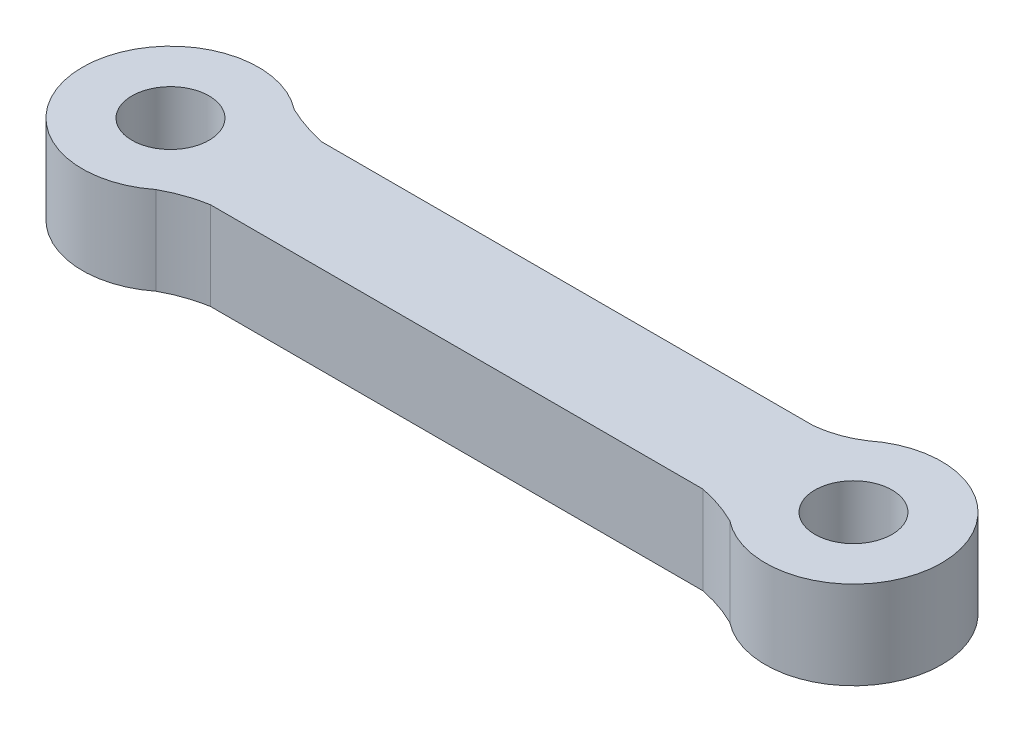
ISO-10303-21;
HEADER;
FILE_DESCRIPTION(('STEP AP214'),'2;1');
FILE_NAME('part.step','',(''),(''),'','','');
FILE_SCHEMA(('AUTOMOTIVE_DESIGN { 1 0 10303 214 1 1 1 1 }'));
ENDSEC;
DATA;
#1=APPLICATION_CONTEXT('core data for automotive mechanical design processes');
#2=APPLICATION_PROTOCOL_DEFINITION('international standard','automotive_design',2000,#1);
#3=PRODUCT_CONTEXT('',#1,'mechanical');
#4=PRODUCT('Part','Part','',(#3));
#5=PRODUCT_RELATED_PRODUCT_CATEGORY('part','',(#4));
#6=PRODUCT_DEFINITION_FORMATION('','',#4);
#7=PRODUCT_DEFINITION_CONTEXT('part definition',#1,'design');
#8=PRODUCT_DEFINITION('design','',#6,#7);
#9=PRODUCT_DEFINITION_SHAPE('','',#8);
#10=(LENGTH_UNIT() NAMED_UNIT(*) SI_UNIT(.MILLI.,.METRE.));
#11=(NAMED_UNIT(*) PLANE_ANGLE_UNIT() SI_UNIT($,.RADIAN.));
#12=(NAMED_UNIT(*) SI_UNIT($,.STERADIAN.) SOLID_ANGLE_UNIT());
#13=UNCERTAINTY_MEASURE_WITH_UNIT(LENGTH_MEASURE(1.E-05),#10,'distance_accuracy_value','');
#14=(GEOMETRIC_REPRESENTATION_CONTEXT(3) GLOBAL_UNCERTAINTY_ASSIGNED_CONTEXT((#13)) GLOBAL_UNIT_ASSIGNED_CONTEXT((#10,
#11,#12)) REPRESENTATION_CONTEXT('',''));
#15=CARTESIAN_POINT('',(0.,0.,0.));
#16=DIRECTION('',(0.,0.,1.));
#17=DIRECTION('',(1.,0.,0.));
#18=AXIS2_PLACEMENT_3D('',#15,#16,#17);
#19=CARTESIAN_POINT('',(12.1316284857943,4.,2.75907287233486));
#20=DIRECTION('',(0.,1.,0.));
#21=DIRECTION('',(0.,0.,1.));
#22=AXIS2_PLACEMENT_3D('',#19,#20,#21);
#23=PLANE('',#22);
#24=CARTESIAN_POINT('',(-15.4995,4.,0.));
#25=DIRECTION('',(0.,1.,0.));
#26=DIRECTION('',(0.,0.,1.));
#27=AXIS2_PLACEMENT_3D('',#24,#25,#26);
#28=CIRCLE('',#27,1.75);
#29=CARTESIAN_POINT('',(-15.4995,4.,1.75));
#30=VERTEX_POINT('',#29);
#31=EDGE_CURVE('E224',#30,#30,#28,.T.);
#32=ORIENTED_EDGE('',*,*,#31,.F.);
#33=EDGE_LOOP('',(#32));
#34=FACE_BOUND('',#33,.T.);
#35=CARTESIAN_POINT('',(11.1719060382681,4.,2.5005385286423));
#36=CARTESIAN_POINT('',(12.1633509333205,4.,2.700124355971));
#37=CARTESIAN_POINT('',(13.0279060382681,4.,3.13550424875513));
#38=B_SPLINE_CURVE_WITH_KNOTS('',2,(#35,#36,#37),.UNSPECIFIED.,.F.,.F.,(3,3),(0.,
0.38103348480159),.UNSPECIFIED.);
#39=CARTESIAN_POINT('',(11.1719060382681,4.,2.5005385286423));
#40=VERTEX_POINT('',#39);
#41=CARTESIAN_POINT('',(13.0279060382681,4.,3.13550424875513));
#42=VERTEX_POINT('',#41);
#43=EDGE_CURVE('E231',#40,#42,#38,.T.);
#44=ORIENTED_EDGE('',*,*,#43,.T.);
#45=CARTESIAN_POINT('',(15.5019060382681,4.,-0.00763494638083683));
#46=DIRECTION('',(0.,1.,0.));
#47=DIRECTION('',(0.,0.,1.));
#48=AXIS2_PLACEMENT_3D('',#45,#46,#47);
#49=CIRCLE('',#48,4.);
#50=CARTESIAN_POINT('',(13.0146335983677,4.,-3.14028172023076));
#51=VERTEX_POINT('',#50);
#52=EDGE_CURVE('E101',#42,#51,#49,.T.);
#53=ORIENTED_EDGE('',*,*,#52,.T.);
#54=CARTESIAN_POINT('',(13.0146335983677,4.,-3.14028172023076));
#55=CARTESIAN_POINT('',(12.2078267194761,4.,-2.6089021850615));
#56=CARTESIAN_POINT('',(11.1719060382681,4.,-2.4994614713577));
#57=B_SPLINE_CURVE_WITH_KNOTS('',2,(#54,#55,#56),.UNSPECIFIED.,.F.,.F.,(3,3),(0.,
0.652329483815014),.UNSPECIFIED.);
#58=CARTESIAN_POINT('',(11.1719060382681,4.,-2.4994614713577));
#59=VERTEX_POINT('',#58);
#60=EDGE_CURVE('E173',#51,#59,#57,.T.);
#61=ORIENTED_EDGE('',*,*,#60,.T.);
#62=DIRECTION('',(-1.,0.,0.));
#63=VECTOR('',#62,1.);
#64=CARTESIAN_POINT('',(-11.1670939617319,4.,-2.4994614713577));
#65=LINE('',#64,#63);
#66=CARTESIAN_POINT('',(-11.1670939617319,4.,-2.4994614713577));
#67=VERTEX_POINT('',#66);
#68=EDGE_CURVE('E167',#59,#67,#65,.T.);
#69=ORIENTED_EDGE('',*,*,#68,.T.);
#70=CARTESIAN_POINT('',(-11.1670939617319,4.,-2.4994614713577));
#71=CARTESIAN_POINT('',(-12.1502379917525,4.,-2.72768663302441));
#72=CARTESIAN_POINT('',(-13.0255,4.,-3.14313919513597));
#73=B_SPLINE_CURVE_WITH_KNOTS('',2,(#70,#71,#72),.UNSPECIFIED.,.F.,.F.,(3,3),(0.,
0.309192528281445),.UNSPECIFIED.);
#74=CARTESIAN_POINT('',(-13.0255,4.,-3.14313919513597));
#75=VERTEX_POINT('',#74);
#76=EDGE_CURVE('E120',#67,#75,#73,.T.);
#77=ORIENTED_EDGE('',*,*,#76,.T.);
#78=CARTESIAN_POINT('',(-15.4995,4.,0.));
#79=DIRECTION('',(0.,1.,0.));
#80=DIRECTION('',(0.,0.,1.));
#81=AXIS2_PLACEMENT_3D('',#78,#79,#80);
#82=CIRCLE('',#81,4.);
#83=CARTESIAN_POINT('',(-13.0255,4.,3.14313919513597));
#84=VERTEX_POINT('',#83);
#85=EDGE_CURVE('E114',#75,#84,#82,.T.);
#86=ORIENTED_EDGE('',*,*,#85,.T.);
#87=CARTESIAN_POINT('',(-13.0255,4.,3.14313919513597));
#88=CARTESIAN_POINT('',(-12.1815028656276,4.,2.67325513686519));
#89=CARTESIAN_POINT('',(-11.1767201884037,4.,2.5005385286423));
#90=B_SPLINE_CURVE_WITH_KNOTS('',2,(#87,#88,#89),.UNSPECIFIED.,.F.,.F.,(3,3),(0.,
0.480047458850535),.UNSPECIFIED.);
#91=CARTESIAN_POINT('',(-11.1767201884037,4.,2.5005385286423));
#92=VERTEX_POINT('',#91);
#93=EDGE_CURVE('E118',#84,#92,#90,.T.);
#94=ORIENTED_EDGE('',*,*,#93,.T.);
#95=DIRECTION('',(1.,0.,0.));
#96=VECTOR('',#95,1.);
#97=CARTESIAN_POINT('',(-11.1767201884037,4.,2.5005385286423));
#98=LINE('',#97,#96);
#99=EDGE_CURVE('E58',#92,#40,#98,.T.);
#100=ORIENTED_EDGE('',*,*,#99,.T.);
#101=EDGE_LOOP('',(#44,#53,#61,#69,#77,#86,#94,#100));
#102=FACE_BOUND('',#101,.T.);
#103=CARTESIAN_POINT('',(15.5019060382681,4.,-0.00763494638083683));
#104=DIRECTION('',(0.,1.,0.));
#105=DIRECTION('',(0.,0.,1.));
#106=AXIS2_PLACEMENT_3D('',#103,#104,#105);
#107=CIRCLE('',#106,1.75);
#108=CARTESIAN_POINT('',(15.5019060382681,4.,1.74236505361916));
#109=VERTEX_POINT('',#108);
#110=EDGE_CURVE('E213',#109,#109,#107,.T.);
#111=ORIENTED_EDGE('',*,*,#110,.F.);
#112=EDGE_LOOP('',(#111));
#113=FACE_BOUND('',#112,.T.);
#114=ADVANCED_FACE('F39',(#34,#102,#113),#23,.T.);
#115=CARTESIAN_POINT('',(12.1316284857943,0.,2.75907287233486));
#116=DIRECTION('',(0.,1.,0.));
#117=DIRECTION('',(0.,0.,1.));
#118=AXIS2_PLACEMENT_3D('',#115,#116,#117);
#119=PLANE('',#118);
#120=CARTESIAN_POINT('',(11.1719060382681,0.,2.5005385286423));
#121=CARTESIAN_POINT('',(12.1633509333205,0.,2.700124355971));
#122=CARTESIAN_POINT('',(13.0279060382681,0.,3.13550424875513));
#123=B_SPLINE_CURVE_WITH_KNOTS('',2,(#120,#121,#122),.UNSPECIFIED.,.F.,.F.,(3,3),(0.,
0.38103348480159),.UNSPECIFIED.);
#124=CARTESIAN_POINT('',(11.1719060382681,0.,2.5005385286423));
#125=VERTEX_POINT('',#124);
#126=CARTESIAN_POINT('',(13.0279060382681,0.,3.13550424875513));
#127=VERTEX_POINT('',#126);
#128=EDGE_CURVE('E228',#125,#127,#123,.T.);
#129=ORIENTED_EDGE('',*,*,#128,.F.);
#130=DIRECTION('',(1.,0.,0.));
#131=VECTOR('',#130,1.);
#132=CARTESIAN_POINT('',(-11.1767201884037,0.,2.5005385286423));
#133=LINE('',#132,#131);
#134=CARTESIAN_POINT('',(-11.1767201884037,0.,2.5005385286423));
#135=VERTEX_POINT('',#134);
#136=EDGE_CURVE('E93',#135,#125,#133,.T.);
#137=ORIENTED_EDGE('',*,*,#136,.F.);
#138=CARTESIAN_POINT('',(-13.0255,0.,3.14313919513597));
#139=CARTESIAN_POINT('',(-12.1815028656276,0.,2.67325513686519));
#140=CARTESIAN_POINT('',(-11.1767201884037,0.,2.5005385286423));
#141=B_SPLINE_CURVE_WITH_KNOTS('',2,(#138,#139,#140),.UNSPECIFIED.,.F.,.F.,(3,3),(0.,
0.480047458850535),.UNSPECIFIED.);
#142=CARTESIAN_POINT('',(-13.0255,0.,3.14313919513597));
#143=VERTEX_POINT('',#142);
#144=EDGE_CURVE('E87',#143,#135,#141,.T.);
#145=ORIENTED_EDGE('',*,*,#144,.F.);
#146=CARTESIAN_POINT('',(-15.4995,0.,0.));
#147=DIRECTION('',(0.,1.,0.));
#148=DIRECTION('',(0.,0.,1.));
#149=AXIS2_PLACEMENT_3D('',#146,#147,#148);
#150=CIRCLE('',#149,4.);
#151=CARTESIAN_POINT('',(-13.0255,0.,-3.14313919513597));
#152=VERTEX_POINT('',#151);
#153=EDGE_CURVE('E129',#152,#143,#150,.T.);
#154=ORIENTED_EDGE('',*,*,#153,.F.);
#155=CARTESIAN_POINT('',(-11.1670939617319,0.,-2.4994614713577));
#156=CARTESIAN_POINT('',(-12.1502379917525,0.,-2.72768663302441));
#157=CARTESIAN_POINT('',(-13.0255,0.,-3.14313919513597));
#158=B_SPLINE_CURVE_WITH_KNOTS('',2,(#155,#156,#157),.UNSPECIFIED.,.F.,.F.,(3,3),(0.,
0.309192528281445),.UNSPECIFIED.);
#159=CARTESIAN_POINT('',(-11.1670939617319,0.,-2.4994614713577));
#160=VERTEX_POINT('',#159);
#161=EDGE_CURVE('E279',#160,#152,#158,.T.);
#162=ORIENTED_EDGE('',*,*,#161,.F.);
#163=DIRECTION('',(-1.,0.,0.));
#164=VECTOR('',#163,1.);
#165=CARTESIAN_POINT('',(-11.1670939617319,0.,-2.4994614713577));
#166=LINE('',#165,#164);
#167=CARTESIAN_POINT('',(11.1719060382681,0.,-2.4994614713577));
#168=VERTEX_POINT('',#167);
#169=EDGE_CURVE('E274',#168,#160,#166,.T.);
#170=ORIENTED_EDGE('',*,*,#169,.F.);
#171=CARTESIAN_POINT('',(13.0146335983677,0.,-3.14028172023076));
#172=CARTESIAN_POINT('',(12.2078267194761,0.,-2.6089021850615));
#173=CARTESIAN_POINT('',(11.1719060382681,0.,-2.4994614713577));
#174=B_SPLINE_CURVE_WITH_KNOTS('',2,(#171,#172,#173),.UNSPECIFIED.,.F.,.F.,(3,3),(0.,
0.652329483815014),.UNSPECIFIED.);
#175=CARTESIAN_POINT('',(13.0146335983677,0.,-3.14028172023076));
#176=VERTEX_POINT('',#175);
#177=EDGE_CURVE('E268',#176,#168,#174,.T.);
#178=ORIENTED_EDGE('',*,*,#177,.F.);
#179=CARTESIAN_POINT('',(15.5019060382681,0.,-0.00763494638083683));
#180=DIRECTION('',(0.,1.,0.));
#181=DIRECTION('',(0.,0.,1.));
#182=AXIS2_PLACEMENT_3D('',#179,#180,#181);
#183=CIRCLE('',#182,4.);
#184=EDGE_CURVE('E272',#127,#176,#183,.T.);
#185=ORIENTED_EDGE('',*,*,#184,.F.);
#186=EDGE_LOOP('',(#129,#137,#145,#154,#162,#170,#178,#185));
#187=FACE_BOUND('',#186,.T.);
#188=CARTESIAN_POINT('',(-15.4995,0.,0.));
#189=DIRECTION('',(0.,1.,0.));
#190=DIRECTION('',(0.,0.,1.));
#191=AXIS2_PLACEMENT_3D('',#188,#189,#190);
#192=CIRCLE('',#191,1.75);
#193=CARTESIAN_POINT('',(-15.4995,0.,1.75));
#194=VERTEX_POINT('',#193);
#195=EDGE_CURVE('E221',#194,#194,#192,.T.);
#196=ORIENTED_EDGE('',*,*,#195,.T.);
#197=EDGE_LOOP('',(#196));
#198=FACE_BOUND('',#197,.T.);
#199=CARTESIAN_POINT('',(15.5019060382681,0.,-0.00763494638083683));
#200=DIRECTION('',(0.,1.,0.));
#201=DIRECTION('',(0.,0.,1.));
#202=AXIS2_PLACEMENT_3D('',#199,#200,#201);
#203=CIRCLE('',#202,1.75);
#204=CARTESIAN_POINT('',(15.5019060382681,0.,1.74236505361916));
#205=VERTEX_POINT('',#204);
#206=EDGE_CURVE('E216',#205,#205,#203,.T.);
#207=ORIENTED_EDGE('',*,*,#206,.T.);
#208=EDGE_LOOP('',(#207));
#209=FACE_BOUND('',#208,.T.);
#210=ADVANCED_FACE('F190',(#187,#198,#209),#119,.F.);
#211=DIRECTION('',(0.,-1.,0.));
#212=VECTOR('',#211,1.);
#213=SURFACE_OF_LINEAR_EXTRUSION('',#38,#212);
#214=ORIENTED_EDGE('',*,*,#128,.T.);
#215=DIRECTION('',(0.,-1.,0.));
#216=VECTOR('',#215,1.);
#217=CARTESIAN_POINT('',(13.0279060382681,4.,3.13550424875513));
#218=LINE('',#217,#216);
#219=EDGE_CURVE('E11',#42,#127,#218,.T.);
#220=ORIENTED_EDGE('',*,*,#219,.F.);
#221=ORIENTED_EDGE('',*,*,#43,.F.);
#222=DIRECTION('',(0.,-1.,0.));
#223=VECTOR('',#222,1.);
#224=CARTESIAN_POINT('',(11.1719060382681,4.,2.5005385286423));
#225=LINE('',#224,#223);
#226=EDGE_CURVE('E138',#40,#125,#225,.T.);
#227=ORIENTED_EDGE('',*,*,#226,.T.);
#228=EDGE_LOOP('',(#214,#220,#221,#227));
#229=FACE_BOUND('',#228,.T.);
#230=ADVANCED_FACE('F41',(#229),#213,.F.);
#231=CARTESIAN_POINT('',(15.5019060382681,4.,-0.00763494638083683));
#232=DIRECTION('',(0.,-1.,0.));
#233=DIRECTION('',(0.,0.,-1.));
#234=AXIS2_PLACEMENT_3D('',#231,#232,#233);
#235=CYLINDRICAL_SURFACE('',#234,4.);
#236=ORIENTED_EDGE('',*,*,#184,.T.);
#237=DIRECTION('',(0.,-1.,0.));
#238=VECTOR('',#237,1.);
#239=CARTESIAN_POINT('',(13.0146335983677,4.,-3.14028172023076));
#240=LINE('',#239,#238);
#241=EDGE_CURVE('E50',#51,#176,#240,.T.);
#242=ORIENTED_EDGE('',*,*,#241,.F.);
#243=ORIENTED_EDGE('',*,*,#52,.F.);
#244=ORIENTED_EDGE('',*,*,#219,.T.);
#245=EDGE_LOOP('',(#236,#242,#243,#244));
#246=FACE_BOUND('',#245,.T.);
#247=ADVANCED_FACE('F184',(#246),#235,.T.);
#248=DIRECTION('',(0.,-1.,0.));
#249=VECTOR('',#248,1.);
#250=SURFACE_OF_LINEAR_EXTRUSION('',#57,#249);
#251=ORIENTED_EDGE('',*,*,#177,.T.);
#252=DIRECTION('',(0.,-1.,0.));
#253=VECTOR('',#252,1.);
#254=CARTESIAN_POINT('',(11.1719060382681,4.,-2.4994614713577));
#255=LINE('',#254,#253);
#256=EDGE_CURVE('E260',#59,#168,#255,.T.);
#257=ORIENTED_EDGE('',*,*,#256,.F.);
#258=ORIENTED_EDGE('',*,*,#60,.F.);
#259=ORIENTED_EDGE('',*,*,#241,.T.);
#260=EDGE_LOOP('',(#251,#257,#258,#259));
#261=FACE_BOUND('',#260,.T.);
#262=ADVANCED_FACE('F182',(#261),#250,.F.);
#263=CARTESIAN_POINT('',(-11.1670939617319,4.,-2.4994614713577));
#264=DIRECTION('',(0.,0.,1.));
#265=DIRECTION('',(1.,0.,0.));
#266=AXIS2_PLACEMENT_3D('',#263,#264,#265);
#267=PLANE('',#266);
#268=ORIENTED_EDGE('',*,*,#169,.T.);
#269=DIRECTION('',(0.,-1.,0.));
#270=VECTOR('',#269,1.);
#271=CARTESIAN_POINT('',(-11.1670939617319,4.,-2.4994614713577));
#272=LINE('',#271,#270);
#273=EDGE_CURVE('E256',#67,#160,#272,.T.);
#274=ORIENTED_EDGE('',*,*,#273,.F.);
#275=ORIENTED_EDGE('',*,*,#68,.F.);
#276=ORIENTED_EDGE('',*,*,#256,.T.);
#277=EDGE_LOOP('',(#268,#274,#275,#276));
#278=FACE_BOUND('',#277,.T.);
#279=ADVANCED_FACE('F159',(#278),#267,.F.);
#280=DIRECTION('',(0.,-1.,0.));
#281=VECTOR('',#280,1.);
#282=SURFACE_OF_LINEAR_EXTRUSION('',#73,#281);
#283=ORIENTED_EDGE('',*,*,#161,.T.);
#284=DIRECTION('',(0.,-1.,0.));
#285=VECTOR('',#284,1.);
#286=CARTESIAN_POINT('',(-13.0255,4.,-3.14313919513597));
#287=LINE('',#286,#285);
#288=EDGE_CURVE('E131',#75,#152,#287,.T.);
#289=ORIENTED_EDGE('',*,*,#288,.F.);
#290=ORIENTED_EDGE('',*,*,#76,.F.);
#291=ORIENTED_EDGE('',*,*,#273,.T.);
#292=EDGE_LOOP('',(#283,#289,#290,#291));
#293=FACE_BOUND('',#292,.T.);
#294=ADVANCED_FACE('F156',(#293),#282,.F.);
#295=CARTESIAN_POINT('',(-15.4995,4.,0.));
#296=DIRECTION('',(0.,-1.,0.));
#297=DIRECTION('',(0.,0.,-1.));
#298=AXIS2_PLACEMENT_3D('',#295,#296,#297);
#299=CYLINDRICAL_SURFACE('',#298,4.);
#300=ORIENTED_EDGE('',*,*,#153,.T.);
#301=DIRECTION('',(0.,-1.,0.));
#302=VECTOR('',#301,1.);
#303=CARTESIAN_POINT('',(-13.0255,4.,3.14313919513597));
#304=LINE('',#303,#302);
#305=EDGE_CURVE('E126',#84,#143,#304,.T.);
#306=ORIENTED_EDGE('',*,*,#305,.F.);
#307=ORIENTED_EDGE('',*,*,#85,.F.);
#308=ORIENTED_EDGE('',*,*,#288,.T.);
#309=EDGE_LOOP('',(#300,#306,#307,#308));
#310=FACE_BOUND('',#309,.T.);
#311=ADVANCED_FACE('F127',(#310),#299,.T.);
#312=DIRECTION('',(0.,-1.,0.));
#313=VECTOR('',#312,1.);
#314=SURFACE_OF_LINEAR_EXTRUSION('',#90,#313);
#315=ORIENTED_EDGE('',*,*,#144,.T.);
#316=DIRECTION('',(0.,-1.,0.));
#317=VECTOR('',#316,1.);
#318=CARTESIAN_POINT('',(-11.1767201884037,4.,2.5005385286423));
#319=LINE('',#318,#317);
#320=EDGE_CURVE('E132',#92,#135,#319,.T.);
#321=ORIENTED_EDGE('',*,*,#320,.F.);
#322=ORIENTED_EDGE('',*,*,#93,.F.);
#323=ORIENTED_EDGE('',*,*,#305,.T.);
#324=EDGE_LOOP('',(#315,#321,#322,#323));
#325=FACE_BOUND('',#324,.T.);
#326=ADVANCED_FACE('F134',(#325),#314,.F.);
#327=CARTESIAN_POINT('',(-11.1767201884037,4.,2.5005385286423));
#328=DIRECTION('',(0.,0.,-1.));
#329=DIRECTION('',(-1.,0.,0.));
#330=AXIS2_PLACEMENT_3D('',#327,#328,#329);
#331=PLANE('',#330);
#332=ORIENTED_EDGE('',*,*,#136,.T.);
#333=ORIENTED_EDGE('',*,*,#226,.F.);
#334=ORIENTED_EDGE('',*,*,#99,.F.);
#335=ORIENTED_EDGE('',*,*,#320,.T.);
#336=EDGE_LOOP('',(#332,#333,#334,#335));
#337=FACE_BOUND('',#336,.T.);
#338=ADVANCED_FACE('F152',(#337),#331,.F.);
#339=CARTESIAN_POINT('',(-15.4995,4.,0.));
#340=DIRECTION('',(0.,-1.,0.));
#341=DIRECTION('',(0.,0.,-1.));
#342=AXIS2_PLACEMENT_3D('',#339,#340,#341);
#343=CYLINDRICAL_SURFACE('',#342,1.75);
#344=ORIENTED_EDGE('',*,*,#31,.T.);
#345=EDGE_LOOP('',(#344));
#346=FACE_BOUND('',#345,.T.);
#347=ORIENTED_EDGE('',*,*,#195,.F.);
#348=EDGE_LOOP('',(#347));
#349=FACE_BOUND('',#348,.T.);
#350=ADVANCED_FACE('F201',(#346,#349),#343,.F.);
#351=CARTESIAN_POINT('',(15.5019060382681,4.,-0.00763494638083683));
#352=DIRECTION('',(0.,-1.,0.));
#353=DIRECTION('',(0.,0.,-1.));
#354=AXIS2_PLACEMENT_3D('',#351,#352,#353);
#355=CYLINDRICAL_SURFACE('',#354,1.75);
#356=ORIENTED_EDGE('',*,*,#110,.T.);
#357=EDGE_LOOP('',(#356));
#358=FACE_BOUND('',#357,.T.);
#359=ORIENTED_EDGE('',*,*,#206,.F.);
#360=EDGE_LOOP('',(#359));
#361=FACE_BOUND('',#360,.T.);
#362=ADVANCED_FACE('F204',(#358,#361),#355,.F.);
#363=CLOSED_SHELL('',(#114,#210,#230,#247,#262,#279,#294,#311,#326,#338,#350,#362));
#364=MANIFOLD_SOLID_BREP('B2',#363);
#365=ADVANCED_BREP_SHAPE_REPRESENTATION('',(#18,#364),#14);
#366=SHAPE_DEFINITION_REPRESENTATION(#9,#365);
ENDSEC;
END-ISO-10303-21;
